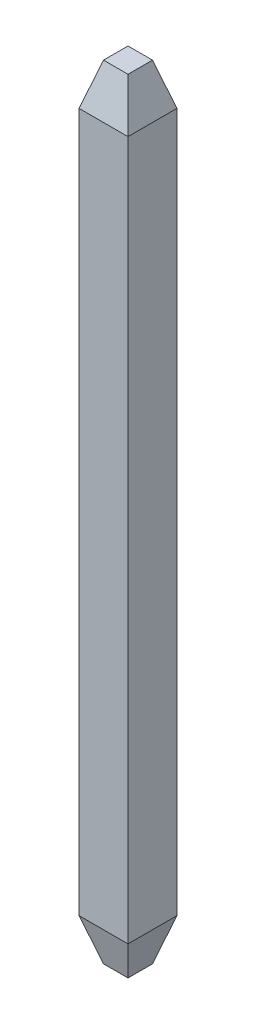
ISO-10303-21;
HEADER;
FILE_DESCRIPTION(('STEP AP214'),'2;1');
FILE_NAME('part.step','',(''),(''),'','','');
FILE_SCHEMA(('AUTOMOTIVE_DESIGN { 1 0 10303 214 1 1 1 1 }'));
ENDSEC;
DATA;
#1=APPLICATION_CONTEXT('core data for automotive mechanical design processes');
#2=APPLICATION_PROTOCOL_DEFINITION('international standard','automotive_design',2000,#1);
#3=PRODUCT_CONTEXT('',#1,'mechanical');
#4=PRODUCT('Part','Part','',(#3));
#5=PRODUCT_RELATED_PRODUCT_CATEGORY('part','',(#4));
#6=PRODUCT_DEFINITION_FORMATION('','',#4);
#7=PRODUCT_DEFINITION_CONTEXT('part definition',#1,'design');
#8=PRODUCT_DEFINITION('design','',#6,#7);
#9=PRODUCT_DEFINITION_SHAPE('','',#8);
#10=(LENGTH_UNIT() NAMED_UNIT(*) SI_UNIT(.MILLI.,.METRE.));
#11=(NAMED_UNIT(*) PLANE_ANGLE_UNIT() SI_UNIT($,.RADIAN.));
#12=(NAMED_UNIT(*) SI_UNIT($,.STERADIAN.) SOLID_ANGLE_UNIT());
#13=UNCERTAINTY_MEASURE_WITH_UNIT(LENGTH_MEASURE(1.E-05),#10,'distance_accuracy_value','');
#14=(GEOMETRIC_REPRESENTATION_CONTEXT(3) GLOBAL_UNCERTAINTY_ASSIGNED_CONTEXT((#13)) GLOBAL_UNIT_ASSIGNED_CONTEXT((#10,
#11,#12)) REPRESENTATION_CONTEXT('',''));
#15=CARTESIAN_POINT('',(0.,0.,0.));
#16=DIRECTION('',(0.,0.,1.));
#17=DIRECTION('',(1.,0.,0.));
#18=AXIS2_PLACEMENT_3D('',#15,#16,#17);
#19=CARTESIAN_POINT('',(-8.72999999998702,-0.965870106912693,-19.1999999999763));
#20=DIRECTION('',(0.,0.281214622974643,0.959644900900968));
#21=DIRECTION('',(1.,0.,0.));
#22=AXIS2_PLACEMENT_3D('',#19,#20,#21);
#23=PLANE('',#22);
#24=DIRECTION('',(-0.27071401714771,0.923811583516622,-0.270714017147728));
#25=VECTOR('',#24,1.);
#26=CARTESIAN_POINT('',(-8.40999999998701,-0.965870106912693,-19.1999999999763));
#27=LINE('',#26,#25);
#28=CARTESIAN_POINT('',(-8.40999999998704,-0.965870106912691,-19.1999999999763));
#29=VERTEX_POINT('',#28);
#30=CARTESIAN_POINT('',(-8.56999999998703,-0.419870106912692,-19.3599999999763));
#31=VERTEX_POINT('',#30);
#32=EDGE_CURVE('E11',#29,#31,#27,.T.);
#33=ORIENTED_EDGE('',*,*,#32,.T.);
#34=DIRECTION('',(-1.,0.,0.));
#35=VECTOR('',#34,1.);
#36=CARTESIAN_POINT('',(-8.569999999987,-0.419870106912693,-19.3599999999763));
#37=LINE('',#36,#35);
#38=CARTESIAN_POINT('',(-8.88999999998703,-0.419870106912692,-19.3599999999763));
#39=VERTEX_POINT('',#38);
#40=EDGE_CURVE('E27',#31,#39,#37,.T.);
#41=ORIENTED_EDGE('',*,*,#40,.T.);
#42=DIRECTION('',(0.270714017147713,0.923811583516621,-0.270714017147728));
#43=VECTOR('',#42,1.);
#44=CARTESIAN_POINT('',(-9.04999999998702,-0.965870106912693,-19.1999999999763));
#45=LINE('',#44,#43);
#46=CARTESIAN_POINT('',(-9.04999999998702,-0.965870106912691,-19.1999999999763));
#47=VERTEX_POINT('',#46);
#48=EDGE_CURVE('E169',#47,#39,#45,.T.);
#49=ORIENTED_EDGE('',*,*,#48,.F.);
#50=DIRECTION('',(-1.,0.,0.));
#51=VECTOR('',#50,1.);
#52=CARTESIAN_POINT('',(-8.40999999998701,-0.965870106912693,-19.1999999999763));
#53=LINE('',#52,#51);
#54=EDGE_CURVE('E171',#29,#47,#53,.T.);
#55=ORIENTED_EDGE('',*,*,#54,.F.);
#56=EDGE_LOOP('',(#33,#41,#49,#55));
#57=FACE_BOUND('',#56,.T.);
#58=ADVANCED_FACE('F17',(#57),#23,.T.);
#59=CARTESIAN_POINT('',(-8.40999999998701,-0.965870106912693,-19.5199999999763));
#60=DIRECTION('',(0.959644900900974,0.281214622974625,0.));
#61=DIRECTION('',(0.,0.,-1.));
#62=AXIS2_PLACEMENT_3D('',#59,#60,#61);
#63=PLANE('',#62);
#64=DIRECTION('',(-0.27071401714771,0.923811583516622,0.270714017147728));
#65=VECTOR('',#64,1.);
#66=CARTESIAN_POINT('',(-8.40999999998701,-0.965870106912693,-19.8399999999763));
#67=LINE('',#66,#65);
#68=CARTESIAN_POINT('',(-8.40999999998704,-0.965870106912691,-19.8399999999763));
#69=VERTEX_POINT('',#68);
#70=CARTESIAN_POINT('',(-8.56999999998703,-0.419870106912692,-19.6799999999763));
#71=VERTEX_POINT('',#70);
#72=EDGE_CURVE('E104',#69,#71,#67,.T.);
#73=ORIENTED_EDGE('',*,*,#72,.T.);
#74=DIRECTION('',(0.,0.,1.));
#75=VECTOR('',#74,1.);
#76=CARTESIAN_POINT('',(-8.569999999987,-0.419870106912693,-19.6799999999763));
#77=LINE('',#76,#75);
#78=EDGE_CURVE('E95',#71,#31,#77,.T.);
#79=ORIENTED_EDGE('',*,*,#78,.T.);
#80=ORIENTED_EDGE('',*,*,#32,.F.);
#81=DIRECTION('',(0.,0.,1.));
#82=VECTOR('',#81,1.);
#83=CARTESIAN_POINT('',(-8.40999999998701,-0.965870106912693,-19.8399999999763));
#84=LINE('',#83,#82);
#85=EDGE_CURVE('E110',#69,#29,#84,.T.);
#86=ORIENTED_EDGE('',*,*,#85,.F.);
#87=EDGE_LOOP('',(#73,#79,#80,#86));
#88=FACE_BOUND('',#87,.T.);
#89=ADVANCED_FACE('F108',(#88),#63,.T.);
#90=CARTESIAN_POINT('',(-8.72999999998702,-0.965870106912693,-19.8399999999763));
#91=DIRECTION('',(0.,0.281214622974643,-0.959644900900968));
#92=DIRECTION('',(-1.,0.,0.));
#93=AXIS2_PLACEMENT_3D('',#90,#91,#92);
#94=PLANE('',#93);
#95=DIRECTION('',(0.270714017147713,0.923811583516621,0.270714017147728));
#96=VECTOR('',#95,1.);
#97=CARTESIAN_POINT('',(-9.04999999998702,-0.965870106912693,-19.8399999999763));
#98=LINE('',#97,#96);
#99=CARTESIAN_POINT('',(-9.04999999998702,-0.965870106912691,-19.8399999999763));
#100=VERTEX_POINT('',#99);
#101=CARTESIAN_POINT('',(-8.88999999998703,-0.419870106912692,-19.6799999999763));
#102=VERTEX_POINT('',#101);
#103=EDGE_CURVE('E105',#100,#102,#98,.T.);
#104=ORIENTED_EDGE('',*,*,#103,.T.);
#105=DIRECTION('',(1.,0.,0.));
#106=VECTOR('',#105,1.);
#107=CARTESIAN_POINT('',(-8.88999999998703,-0.419870106912693,-19.6799999999763));
#108=LINE('',#107,#106);
#109=EDGE_CURVE('E99',#102,#71,#108,.T.);
#110=ORIENTED_EDGE('',*,*,#109,.T.);
#111=ORIENTED_EDGE('',*,*,#72,.F.);
#112=DIRECTION('',(1.,0.,0.));
#113=VECTOR('',#112,1.);
#114=CARTESIAN_POINT('',(-9.04999999998702,-0.965870106912693,-19.8399999999763));
#115=LINE('',#114,#113);
#116=EDGE_CURVE('E130',#100,#69,#115,.T.);
#117=ORIENTED_EDGE('',*,*,#116,.F.);
#118=EDGE_LOOP('',(#104,#110,#111,#117));
#119=FACE_BOUND('',#118,.T.);
#120=ADVANCED_FACE('F117',(#119),#94,.T.);
#121=CARTESIAN_POINT('',(-8.408999999987,-5.53443505344795,-19.8399999999763));
#122=DIRECTION('',(0.,0.,-1.));
#123=DIRECTION('',(0.,-1.,0.));
#124=AXIS2_PLACEMENT_3D('',#121,#122,#123);
#125=PLANE('',#124);
#126=DIRECTION('',(0.,1.,0.));
#127=VECTOR('',#126,1.);
#128=CARTESIAN_POINT('',(-8.40999999998701,-10.1039999999832,-19.8399999999763));
#129=LINE('',#128,#127);
#130=CARTESIAN_POINT('',(-8.40999999998704,-10.1039999999832,-19.8399999999763));
#131=VERTEX_POINT('',#130);
#132=EDGE_CURVE('E185',#131,#69,#129,.T.);
#133=ORIENTED_EDGE('',*,*,#132,.F.);
#134=DIRECTION('',(1.,0.,0.));
#135=VECTOR('',#134,1.);
#136=CARTESIAN_POINT('',(-9.04999999998702,-10.1039999999832,-19.8399999999763));
#137=LINE('',#136,#135);
#138=CARTESIAN_POINT('',(-9.04999999998702,-10.1039999999832,-19.8399999999763));
#139=VERTEX_POINT('',#138);
#140=EDGE_CURVE('E158',#139,#131,#137,.T.);
#141=ORIENTED_EDGE('',*,*,#140,.F.);
#142=DIRECTION('',(0.,1.,0.));
#143=VECTOR('',#142,1.);
#144=CARTESIAN_POINT('',(-9.04999999998702,-10.1039999999832,-19.8399999999763));
#145=LINE('',#144,#143);
#146=EDGE_CURVE('E121',#139,#100,#145,.T.);
#147=ORIENTED_EDGE('',*,*,#146,.T.);
#148=ORIENTED_EDGE('',*,*,#116,.T.);
#149=EDGE_LOOP('',(#133,#141,#147,#148));
#150=FACE_BOUND('',#149,.T.);
#151=ADVANCED_FACE('F252',(#150),#125,.T.);
#152=CARTESIAN_POINT('',(-9.04999999998702,-5.53543505344795,-19.1989999999763));
#153=DIRECTION('',(-1.,0.,0.));
#154=DIRECTION('',(0.,0.,1.));
#155=AXIS2_PLACEMENT_3D('',#152,#153,#154);
#156=PLANE('',#155);
#157=ORIENTED_EDGE('',*,*,#146,.F.);
#158=DIRECTION('',(0.,0.,-1.));
#159=VECTOR('',#158,1.);
#160=CARTESIAN_POINT('',(-9.04999999998702,-10.1039999999832,-19.1999999999763));
#161=LINE('',#160,#159);
#162=CARTESIAN_POINT('',(-9.04999999998702,-10.1039999999832,-19.1999999999763));
#163=VERTEX_POINT('',#162);
#164=EDGE_CURVE('E139',#163,#139,#161,.T.);
#165=ORIENTED_EDGE('',*,*,#164,.F.);
#166=DIRECTION('',(0.,1.,0.));
#167=VECTOR('',#166,1.);
#168=CARTESIAN_POINT('',(-9.04999999998702,-10.1039999999832,-19.1999999999763));
#169=LINE('',#168,#167);
#170=EDGE_CURVE('E176',#163,#47,#169,.T.);
#171=ORIENTED_EDGE('',*,*,#170,.T.);
#172=DIRECTION('',(0.,0.,-1.));
#173=VECTOR('',#172,1.);
#174=CARTESIAN_POINT('',(-9.04999999998702,-0.965870106912693,-19.1999999999763));
#175=LINE('',#174,#173);
#176=EDGE_CURVE('E180',#47,#100,#175,.T.);
#177=ORIENTED_EDGE('',*,*,#176,.T.);
#178=EDGE_LOOP('',(#157,#165,#171,#177));
#179=FACE_BOUND('',#178,.T.);
#180=ADVANCED_FACE('F244',(#179),#156,.T.);
#181=CARTESIAN_POINT('',(-9.04999999998702,-10.1039999999832,-19.5199999999763));
#182=DIRECTION('',(-0.959644900900973,-0.281214622974629,0.));
#183=DIRECTION('',(-0.281214622974629,0.959644900900973,0.));
#184=AXIS2_PLACEMENT_3D('',#181,#182,#183);
#185=PLANE('',#184);
#186=ORIENTED_EDGE('',*,*,#164,.T.);
#187=DIRECTION('',(0.270714017147713,-0.923811583516621,0.270714017147728));
#188=VECTOR('',#187,1.);
#189=CARTESIAN_POINT('',(-9.04999999998702,-10.1039999999832,-19.8399999999763));
#190=LINE('',#189,#188);
#191=CARTESIAN_POINT('',(-8.88999999998703,-10.6499999999832,-19.6799999999763));
#192=VERTEX_POINT('',#191);
#193=EDGE_CURVE('E136',#139,#192,#190,.T.);
#194=ORIENTED_EDGE('',*,*,#193,.T.);
#195=DIRECTION('',(0.,0.,-1.));
#196=VECTOR('',#195,1.);
#197=CARTESIAN_POINT('',(-8.88999999998703,-10.6499999999832,-19.3599999999763));
#198=LINE('',#197,#196);
#199=CARTESIAN_POINT('',(-8.88999999998703,-10.6499999999832,-19.3599999999763));
#200=VERTEX_POINT('',#199);
#201=EDGE_CURVE('E134',#200,#192,#198,.T.);
#202=ORIENTED_EDGE('',*,*,#201,.F.);
#203=DIRECTION('',(0.270714017147713,-0.923811583516621,-0.270714017147728));
#204=VECTOR('',#203,1.);
#205=CARTESIAN_POINT('',(-9.04999999998702,-10.1039999999832,-19.1999999999763));
#206=LINE('',#205,#204);
#207=EDGE_CURVE('E200',#163,#200,#206,.T.);
#208=ORIENTED_EDGE('',*,*,#207,.F.);
#209=EDGE_LOOP('',(#186,#194,#202,#208));
#210=FACE_BOUND('',#209,.T.);
#211=ADVANCED_FACE('F242',(#210),#185,.T.);
#212=CARTESIAN_POINT('',(-8.72999999998702,-10.1039999999832,-19.1999999999763));
#213=DIRECTION('',(0.,-0.281214622974643,0.959644900900968));
#214=DIRECTION('',(-1.,0.,0.));
#215=AXIS2_PLACEMENT_3D('',#212,#213,#214);
#216=PLANE('',#215);
#217=DIRECTION('',(-1.,0.,0.));
#218=VECTOR('',#217,1.);
#219=CARTESIAN_POINT('',(-8.40999999998701,-10.1039999999832,-19.1999999999763));
#220=LINE('',#219,#218);
#221=CARTESIAN_POINT('',(-8.40999999998704,-10.1039999999832,-19.1999999999763));
#222=VERTEX_POINT('',#221);
#223=EDGE_CURVE('E140',#222,#163,#220,.T.);
#224=ORIENTED_EDGE('',*,*,#223,.T.);
#225=ORIENTED_EDGE('',*,*,#207,.T.);
#226=DIRECTION('',(-1.,0.,0.));
#227=VECTOR('',#226,1.);
#228=CARTESIAN_POINT('',(-8.569999999987,-10.6499999999832,-19.3599999999763));
#229=LINE('',#228,#227);
#230=CARTESIAN_POINT('',(-8.56999999998703,-10.6499999999832,-19.3599999999763));
#231=VERTEX_POINT('',#230);
#232=EDGE_CURVE('E141',#231,#200,#229,.T.);
#233=ORIENTED_EDGE('',*,*,#232,.F.);
#234=DIRECTION('',(-0.27071401714771,-0.923811583516622,-0.270714017147728));
#235=VECTOR('',#234,1.);
#236=CARTESIAN_POINT('',(-8.40999999998701,-10.1039999999832,-19.1999999999763));
#237=LINE('',#236,#235);
#238=EDGE_CURVE('E151',#222,#231,#237,.T.);
#239=ORIENTED_EDGE('',*,*,#238,.F.);
#240=EDGE_LOOP('',(#224,#225,#233,#239));
#241=FACE_BOUND('',#240,.T.);
#242=ADVANCED_FACE('F229',(#241),#216,.T.);
#243=CARTESIAN_POINT('',(-8.40999999998701,-10.1039999999832,-19.5199999999763));
#244=DIRECTION('',(0.959644900900974,-0.281214622974625,0.));
#245=DIRECTION('',(0.,0.,-1.));
#246=AXIS2_PLACEMENT_3D('',#243,#244,#245);
#247=PLANE('',#246);
#248=DIRECTION('',(0.,0.,1.));
#249=VECTOR('',#248,1.);
#250=CARTESIAN_POINT('',(-8.40999999998701,-10.1039999999832,-19.8399999999763));
#251=LINE('',#250,#249);
#252=EDGE_CURVE('E197',#131,#222,#251,.T.);
#253=ORIENTED_EDGE('',*,*,#252,.T.);
#254=ORIENTED_EDGE('',*,*,#238,.T.);
#255=DIRECTION('',(0.,0.,1.));
#256=VECTOR('',#255,1.);
#257=CARTESIAN_POINT('',(-8.569999999987,-10.6499999999832,-19.6799999999763));
#258=LINE('',#257,#256);
#259=CARTESIAN_POINT('',(-8.56999999998703,-10.6499999999832,-19.6799999999763));
#260=VERTEX_POINT('',#259);
#261=EDGE_CURVE('E144',#260,#231,#258,.T.);
#262=ORIENTED_EDGE('',*,*,#261,.F.);
#263=DIRECTION('',(-0.27071401714771,-0.923811583516622,0.270714017147728));
#264=VECTOR('',#263,1.);
#265=CARTESIAN_POINT('',(-8.40999999998701,-10.1039999999832,-19.8399999999763));
#266=LINE('',#265,#264);
#267=EDGE_CURVE('E165',#131,#260,#266,.T.);
#268=ORIENTED_EDGE('',*,*,#267,.F.);
#269=EDGE_LOOP('',(#253,#254,#262,#268));
#270=FACE_BOUND('',#269,.T.);
#271=ADVANCED_FACE('F19',(#270),#247,.T.);
#272=CARTESIAN_POINT('',(-8.890999999987,-10.6499999999832,-19.5199999999763));
#273=DIRECTION('',(0.,-1.,0.));
#274=DIRECTION('',(0.,0.,-1.));
#275=AXIS2_PLACEMENT_3D('',#272,#273,#274);
#276=PLANE('',#275);
#277=ORIENTED_EDGE('',*,*,#261,.T.);
#278=ORIENTED_EDGE('',*,*,#232,.T.);
#279=ORIENTED_EDGE('',*,*,#201,.T.);
#280=DIRECTION('',(1.,0.,0.));
#281=VECTOR('',#280,1.);
#282=CARTESIAN_POINT('',(-8.88999999998703,-10.6499999999832,-19.6799999999763));
#283=LINE('',#282,#281);
#284=EDGE_CURVE('E153',#192,#260,#283,.T.);
#285=ORIENTED_EDGE('',*,*,#284,.T.);
#286=EDGE_LOOP('',(#277,#278,#279,#285));
#287=FACE_BOUND('',#286,.T.);
#288=ADVANCED_FACE('F216',(#287),#276,.T.);
#289=CARTESIAN_POINT('',(-8.72999999998702,-10.1039999999832,-19.8399999999763));
#290=DIRECTION('',(0.,-0.281214622974643,-0.959644900900968));
#291=DIRECTION('',(0.,-0.959644900900968,0.281214622974643));
#292=AXIS2_PLACEMENT_3D('',#289,#290,#291);
#293=PLANE('',#292);
#294=ORIENTED_EDGE('',*,*,#140,.T.);
#295=ORIENTED_EDGE('',*,*,#267,.T.);
#296=ORIENTED_EDGE('',*,*,#284,.F.);
#297=ORIENTED_EDGE('',*,*,#193,.F.);
#298=EDGE_LOOP('',(#294,#295,#296,#297));
#299=FACE_BOUND('',#298,.T.);
#300=ADVANCED_FACE('F218',(#299),#293,.T.);
#301=CARTESIAN_POINT('',(-8.40999999998701,-11.0738701069127,-19.5199999999763));
#302=DIRECTION('',(1.,0.,0.));
#303=DIRECTION('',(0.,1.,0.));
#304=AXIS2_PLACEMENT_3D('',#301,#302,#303);
#305=PLANE('',#304);
#306=DIRECTION('',(0.,1.,0.));
#307=VECTOR('',#306,1.);
#308=CARTESIAN_POINT('',(-8.40999999998701,-10.1039999999832,-19.1999999999763));
#309=LINE('',#308,#307);
#310=EDGE_CURVE('E188',#222,#29,#309,.T.);
#311=ORIENTED_EDGE('',*,*,#310,.F.);
#312=ORIENTED_EDGE('',*,*,#252,.F.);
#313=ORIENTED_EDGE('',*,*,#132,.T.);
#314=ORIENTED_EDGE('',*,*,#85,.T.);
#315=EDGE_LOOP('',(#311,#312,#313,#314));
#316=FACE_BOUND('',#315,.T.);
#317=ADVANCED_FACE('F226',(#316),#305,.T.);
#318=CARTESIAN_POINT('',(-9.050999999987,-5.53543505344795,-19.1999999999763));
#319=DIRECTION('',(0.,0.,1.));
#320=DIRECTION('',(1.,0.,0.));
#321=AXIS2_PLACEMENT_3D('',#318,#319,#320);
#322=PLANE('',#321);
#323=ORIENTED_EDGE('',*,*,#170,.F.);
#324=ORIENTED_EDGE('',*,*,#223,.F.);
#325=ORIENTED_EDGE('',*,*,#310,.T.);
#326=ORIENTED_EDGE('',*,*,#54,.T.);
#327=EDGE_LOOP('',(#323,#324,#325,#326));
#328=FACE_BOUND('',#327,.T.);
#329=ADVANCED_FACE('F337',(#328),#322,.T.);
#330=CARTESIAN_POINT('',(-9.04999999998702,-0.965870106912693,-19.5199999999763));
#331=DIRECTION('',(-0.959644900900973,0.281214622974629,0.));
#332=DIRECTION('',(0.,0.,1.));
#333=AXIS2_PLACEMENT_3D('',#330,#331,#332);
#334=PLANE('',#333);
#335=ORIENTED_EDGE('',*,*,#48,.T.);
#336=DIRECTION('',(0.,0.,-1.));
#337=VECTOR('',#336,1.);
#338=CARTESIAN_POINT('',(-8.88999999998703,-0.419870106912693,-19.3599999999763));
#339=LINE('',#338,#337);
#340=EDGE_CURVE('E172',#39,#102,#339,.T.);
#341=ORIENTED_EDGE('',*,*,#340,.T.);
#342=ORIENTED_EDGE('',*,*,#103,.F.);
#343=ORIENTED_EDGE('',*,*,#176,.F.);
#344=EDGE_LOOP('',(#335,#341,#342,#343));
#345=FACE_BOUND('',#344,.T.);
#346=ADVANCED_FACE('F340',(#345),#334,.T.);
#347=CARTESIAN_POINT('',(-8.72999999998702,-0.419870106912693,-19.6809999999763));
#348=DIRECTION('',(0.,1.,0.));
#349=DIRECTION('',(1.,0.,0.));
#350=AXIS2_PLACEMENT_3D('',#347,#348,#349);
#351=PLANE('',#350);
#352=ORIENTED_EDGE('',*,*,#109,.F.);
#353=ORIENTED_EDGE('',*,*,#340,.F.);
#354=ORIENTED_EDGE('',*,*,#40,.F.);
#355=ORIENTED_EDGE('',*,*,#78,.F.);
#356=EDGE_LOOP('',(#352,#353,#354,#355));
#357=FACE_BOUND('',#356,.T.);
#358=ADVANCED_FACE('F97',(#357),#351,.T.);
#359=CLOSED_SHELL('',(#58,#89,#120,#151,#180,#211,#242,#271,#288,#300,#317,#329,#346,#358));
#360=MANIFOLD_SOLID_BREP('B1',#359);
#361=ADVANCED_BREP_SHAPE_REPRESENTATION('',(#18,#360),#14);
#362=SHAPE_DEFINITION_REPRESENTATION(#9,#361);
ENDSEC;
END-ISO-10303-21;
